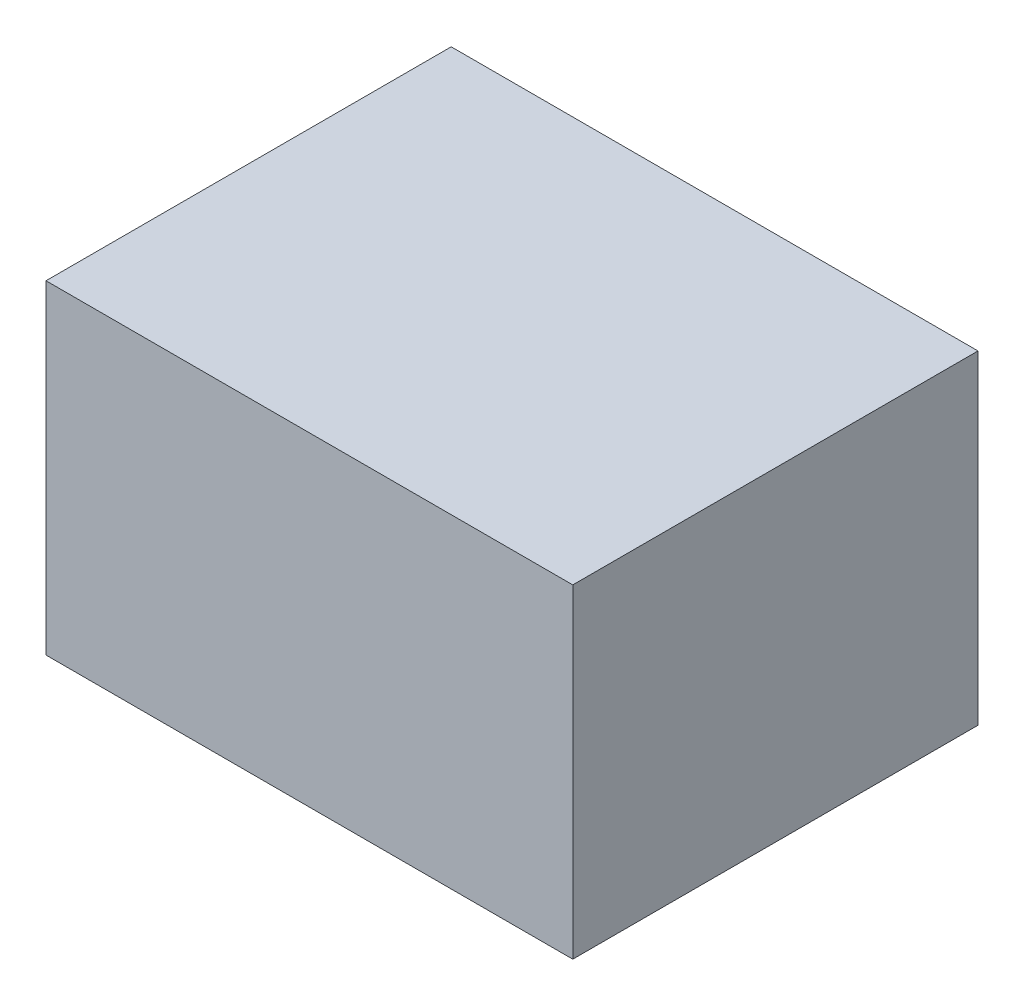
ISO-10303-21;
HEADER;
FILE_DESCRIPTION(('STEP AP214'),'2;1');
FILE_NAME('part.step','',(''),(''),'','','');
FILE_SCHEMA(('AUTOMOTIVE_DESIGN { 1 0 10303 214 1 1 1 1 }'));
ENDSEC;
DATA;
#1=APPLICATION_CONTEXT('core data for automotive mechanical design processes');
#2=APPLICATION_PROTOCOL_DEFINITION('international standard','automotive_design',2000,#1);
#3=PRODUCT_CONTEXT('',#1,'mechanical');
#4=PRODUCT('Part','Part','',(#3));
#5=PRODUCT_RELATED_PRODUCT_CATEGORY('part','',(#4));
#6=PRODUCT_DEFINITION_FORMATION('','',#4);
#7=PRODUCT_DEFINITION_CONTEXT('part definition',#1,'design');
#8=PRODUCT_DEFINITION('design','',#6,#7);
#9=PRODUCT_DEFINITION_SHAPE('','',#8);
#10=(LENGTH_UNIT() NAMED_UNIT(*) SI_UNIT(.MILLI.,.METRE.));
#11=(NAMED_UNIT(*) PLANE_ANGLE_UNIT() SI_UNIT($,.RADIAN.));
#12=(NAMED_UNIT(*) SI_UNIT($,.STERADIAN.) SOLID_ANGLE_UNIT());
#13=UNCERTAINTY_MEASURE_WITH_UNIT(LENGTH_MEASURE(1.E-05),#10,'distance_accuracy_value','');
#14=(GEOMETRIC_REPRESENTATION_CONTEXT(3) GLOBAL_UNCERTAINTY_ASSIGNED_CONTEXT((#13)) GLOBAL_UNIT_ASSIGNED_CONTEXT((#10,
#11,#12)) REPRESENTATION_CONTEXT('',''));
#15=CARTESIAN_POINT('',(0.,0.,0.));
#16=DIRECTION('',(0.,0.,1.));
#17=DIRECTION('',(1.,0.,0.));
#18=AXIS2_PLACEMENT_3D('',#15,#16,#17);
#19=CARTESIAN_POINT('',(0.,0.,50.));
#20=DIRECTION('',(1.,0.,0.));
#21=DIRECTION('',(0.,1.,0.));
#22=AXIS2_PLACEMENT_3D('',#19,#20,#21);
#23=PLANE('',#22);
#24=DIRECTION('',(0.,-1.,0.));
#25=VECTOR('',#24,1.);
#26=CARTESIAN_POINT('',(0.,0.,0.));
#27=LINE('',#26,#25);
#28=CARTESIAN_POINT('',(0.,0.,0.));
#29=VERTEX_POINT('',#28);
#30=CARTESIAN_POINT('',(0.,-40.,0.));
#31=VERTEX_POINT('',#30);
#32=EDGE_CURVE('E96',#29,#31,#27,.T.);
#33=ORIENTED_EDGE('',*,*,#32,.T.);
#34=DIRECTION('',(0.,0.,-1.));
#35=VECTOR('',#34,1.);
#36=CARTESIAN_POINT('',(0.,-40.,50.));
#37=LINE('',#36,#35);
#38=CARTESIAN_POINT('',(0.,-40.,50.));
#39=VERTEX_POINT('',#38);
#40=EDGE_CURVE('E11',#39,#31,#37,.T.);
#41=ORIENTED_EDGE('',*,*,#40,.F.);
#42=DIRECTION('',(0.,-1.,0.));
#43=VECTOR('',#42,1.);
#44=CARTESIAN_POINT('',(0.,0.,50.));
#45=LINE('',#44,#43);
#46=CARTESIAN_POINT('',(0.,0.,50.));
#47=VERTEX_POINT('',#46);
#48=EDGE_CURVE('E84',#47,#39,#45,.T.);
#49=ORIENTED_EDGE('',*,*,#48,.F.);
#50=DIRECTION('',(0.,0.,-1.));
#51=VECTOR('',#50,1.);
#52=CARTESIAN_POINT('',(0.,0.,50.));
#53=LINE('',#52,#51);
#54=EDGE_CURVE('E92',#47,#29,#53,.T.);
#55=ORIENTED_EDGE('',*,*,#54,.T.);
#56=EDGE_LOOP('',(#33,#41,#49,#55));
#57=FACE_BOUND('',#56,.T.);
#58=ADVANCED_FACE('F33',(#57),#23,.F.);
#59=CARTESIAN_POINT('',(0.,-40.,50.));
#60=DIRECTION('',(0.,1.,0.));
#61=DIRECTION('',(0.,0.,1.));
#62=AXIS2_PLACEMENT_3D('',#59,#60,#61);
#63=PLANE('',#62);
#64=DIRECTION('',(1.,0.,0.));
#65=VECTOR('',#64,1.);
#66=CARTESIAN_POINT('',(0.,-40.,0.));
#67=LINE('',#66,#65);
#68=CARTESIAN_POINT('',(65.,-40.,0.));
#69=VERTEX_POINT('',#68);
#70=EDGE_CURVE('E88',#31,#69,#67,.T.);
#71=ORIENTED_EDGE('',*,*,#70,.T.);
#72=DIRECTION('',(0.,0.,-1.));
#73=VECTOR('',#72,1.);
#74=CARTESIAN_POINT('',(65.,-40.,50.));
#75=LINE('',#74,#73);
#76=CARTESIAN_POINT('',(65.,-40.,50.));
#77=VERTEX_POINT('',#76);
#78=EDGE_CURVE('E41',#77,#69,#75,.T.);
#79=ORIENTED_EDGE('',*,*,#78,.F.);
#80=DIRECTION('',(1.,0.,0.));
#81=VECTOR('',#80,1.);
#82=CARTESIAN_POINT('',(0.,-40.,50.));
#83=LINE('',#82,#81);
#84=EDGE_CURVE('E79',#39,#77,#83,.T.);
#85=ORIENTED_EDGE('',*,*,#84,.F.);
#86=ORIENTED_EDGE('',*,*,#40,.T.);
#87=EDGE_LOOP('',(#71,#79,#85,#86));
#88=FACE_BOUND('',#87,.T.);
#89=ADVANCED_FACE('F87',(#88),#63,.F.);
#90=CARTESIAN_POINT('',(65.,0.,50.));
#91=DIRECTION('',(-1.,0.,0.));
#92=DIRECTION('',(0.,0.,1.));
#93=AXIS2_PLACEMENT_3D('',#90,#91,#92);
#94=PLANE('',#93);
#95=DIRECTION('',(0.,1.,0.));
#96=VECTOR('',#95,1.);
#97=CARTESIAN_POINT('',(65.,0.,0.));
#98=LINE('',#97,#96);
#99=CARTESIAN_POINT('',(65.,0.,0.));
#100=VERTEX_POINT('',#99);
#101=EDGE_CURVE('E66',#69,#100,#98,.T.);
#102=ORIENTED_EDGE('',*,*,#101,.T.);
#103=DIRECTION('',(0.,0.,-1.));
#104=VECTOR('',#103,1.);
#105=CARTESIAN_POINT('',(65.,0.,50.));
#106=LINE('',#105,#104);
#107=CARTESIAN_POINT('',(65.,0.,50.));
#108=VERTEX_POINT('',#107);
#109=EDGE_CURVE('E89',#108,#100,#106,.T.);
#110=ORIENTED_EDGE('',*,*,#109,.F.);
#111=DIRECTION('',(0.,1.,0.));
#112=VECTOR('',#111,1.);
#113=CARTESIAN_POINT('',(65.,0.,50.));
#114=LINE('',#113,#112);
#115=EDGE_CURVE('E82',#77,#108,#114,.T.);
#116=ORIENTED_EDGE('',*,*,#115,.F.);
#117=ORIENTED_EDGE('',*,*,#78,.T.);
#118=EDGE_LOOP('',(#102,#110,#116,#117));
#119=FACE_BOUND('',#118,.T.);
#120=ADVANCED_FACE('F90',(#119),#94,.F.);
#121=CARTESIAN_POINT('',(0.,0.,50.));
#122=DIRECTION('',(0.,-1.,0.));
#123=DIRECTION('',(0.,0.,-1.));
#124=AXIS2_PLACEMENT_3D('',#121,#122,#123);
#125=PLANE('',#124);
#126=DIRECTION('',(-1.,0.,0.));
#127=VECTOR('',#126,1.);
#128=CARTESIAN_POINT('',(0.,0.,0.));
#129=LINE('',#128,#127);
#130=EDGE_CURVE('E72',#100,#29,#129,.T.);
#131=ORIENTED_EDGE('',*,*,#130,.T.);
#132=ORIENTED_EDGE('',*,*,#54,.F.);
#133=DIRECTION('',(-1.,0.,0.));
#134=VECTOR('',#133,1.);
#135=CARTESIAN_POINT('',(0.,0.,50.));
#136=LINE('',#135,#134);
#137=EDGE_CURVE('E49',#108,#47,#136,.T.);
#138=ORIENTED_EDGE('',*,*,#137,.F.);
#139=ORIENTED_EDGE('',*,*,#109,.T.);
#140=EDGE_LOOP('',(#131,#132,#138,#139));
#141=FACE_BOUND('',#140,.T.);
#142=ADVANCED_FACE('F103',(#141),#125,.F.);
#143=CARTESIAN_POINT('',(0.,0.,50.));
#144=DIRECTION('',(0.,0.,1.));
#145=DIRECTION('',(1.,0.,0.));
#146=AXIS2_PLACEMENT_3D('',#143,#144,#145);
#147=PLANE('',#146);
#148=ORIENTED_EDGE('',*,*,#48,.T.);
#149=ORIENTED_EDGE('',*,*,#84,.T.);
#150=ORIENTED_EDGE('',*,*,#115,.T.);
#151=ORIENTED_EDGE('',*,*,#137,.T.);
#152=EDGE_LOOP('',(#148,#149,#150,#151));
#153=FACE_BOUND('',#152,.T.);
#154=ADVANCED_FACE('F80',(#153),#147,.T.);
#155=CARTESIAN_POINT('',(0.,0.,0.));
#156=DIRECTION('',(0.,0.,1.));
#157=DIRECTION('',(1.,0.,0.));
#158=AXIS2_PLACEMENT_3D('',#155,#156,#157);
#159=PLANE('',#158);
#160=ORIENTED_EDGE('',*,*,#32,.F.);
#161=ORIENTED_EDGE('',*,*,#130,.F.);
#162=ORIENTED_EDGE('',*,*,#101,.F.);
#163=ORIENTED_EDGE('',*,*,#70,.F.);
#164=EDGE_LOOP('',(#160,#161,#162,#163));
#165=FACE_BOUND('',#164,.T.);
#166=ADVANCED_FACE('F106',(#165),#159,.F.);
#167=CLOSED_SHELL('',(#58,#89,#120,#142,#154,#166));
#168=MANIFOLD_SOLID_BREP('B2',#167);
#169=ADVANCED_BREP_SHAPE_REPRESENTATION('',(#18,#168),#14);
#170=SHAPE_DEFINITION_REPRESENTATION(#9,#169);
ENDSEC;
END-ISO-10303-21;
